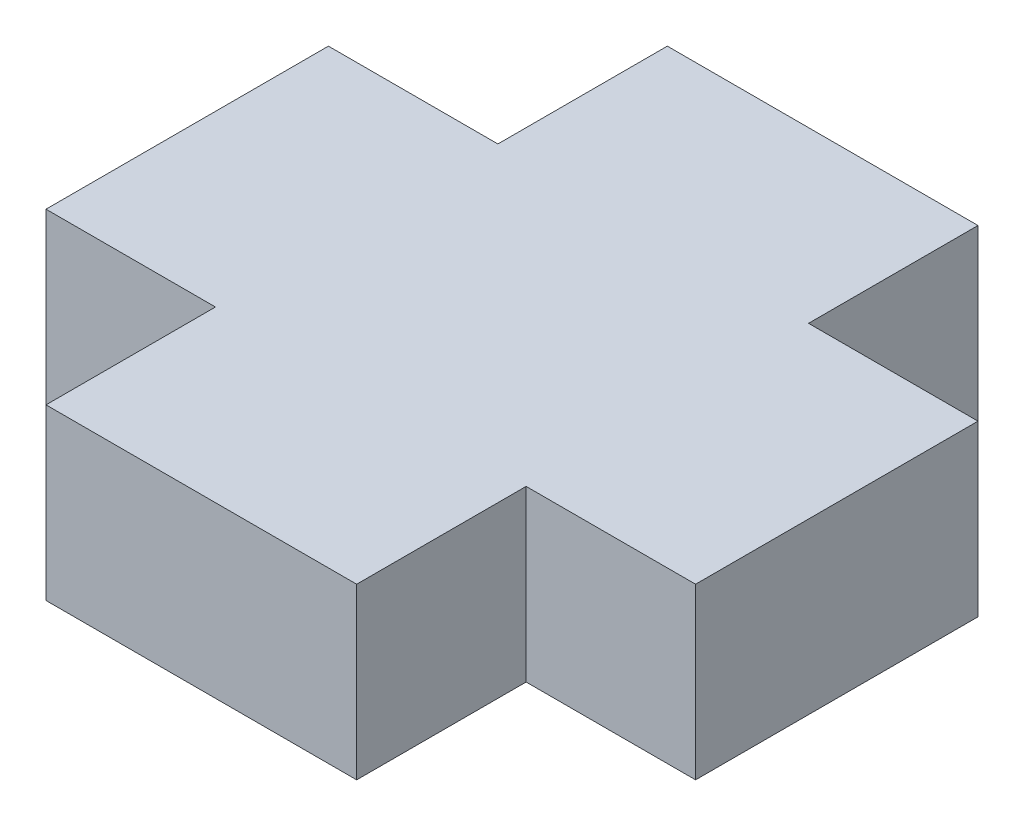
ISO-10303-21;
HEADER;
FILE_DESCRIPTION(('STEP AP214'),'2;1');
FILE_NAME('part.step','',(''),(''),'','','');
FILE_SCHEMA(('AUTOMOTIVE_DESIGN { 1 0 10303 214 1 1 1 1 }'));
ENDSEC;
DATA;
#1=APPLICATION_CONTEXT('core data for automotive mechanical design processes');
#2=APPLICATION_PROTOCOL_DEFINITION('international standard','automotive_design',2000,#1);
#3=PRODUCT_CONTEXT('',#1,'mechanical');
#4=PRODUCT('Part','Part','',(#3));
#5=PRODUCT_RELATED_PRODUCT_CATEGORY('part','',(#4));
#6=PRODUCT_DEFINITION_FORMATION('','',#4);
#7=PRODUCT_DEFINITION_CONTEXT('part definition',#1,'design');
#8=PRODUCT_DEFINITION('design','',#6,#7);
#9=PRODUCT_DEFINITION_SHAPE('','',#8);
#10=(LENGTH_UNIT() NAMED_UNIT(*) SI_UNIT(.MILLI.,.METRE.));
#11=(NAMED_UNIT(*) PLANE_ANGLE_UNIT() SI_UNIT($,.RADIAN.));
#12=(NAMED_UNIT(*) SI_UNIT($,.STERADIAN.) SOLID_ANGLE_UNIT());
#13=UNCERTAINTY_MEASURE_WITH_UNIT(LENGTH_MEASURE(1.E-05),#10,'distance_accuracy_value','');
#14=(GEOMETRIC_REPRESENTATION_CONTEXT(3) GLOBAL_UNCERTAINTY_ASSIGNED_CONTEXT((#13)) GLOBAL_UNIT_ASSIGNED_CONTEXT((#10,
#11,#12)) REPRESENTATION_CONTEXT('',''));
#15=CARTESIAN_POINT('',(0.,0.,0.));
#16=DIRECTION('',(0.,0.,1.));
#17=DIRECTION('',(1.,0.,0.));
#18=AXIS2_PLACEMENT_3D('',#15,#16,#17);
#19=CARTESIAN_POINT('',(-16.2201019104358,3.,-0.655329845418991));
#20=DIRECTION('',(0.,0.,1.));
#21=DIRECTION('',(1.,0.,0.));
#22=AXIS2_PLACEMENT_3D('',#19,#20,#21);
#23=PLANE('',#22);
#24=DIRECTION('',(-1.,0.,0.));
#25=VECTOR('',#24,1.);
#26=CARTESIAN_POINT('',(-16.2201019104358,0.,-0.655329845418991));
#27=LINE('',#26,#25);
#28=CARTESIAN_POINT('',(-13.2201019104358,0.,-0.655329845418991));
#29=VERTEX_POINT('',#28);
#30=CARTESIAN_POINT('',(-16.2201019104358,0.,-0.655329845418991));
#31=VERTEX_POINT('',#30);
#32=EDGE_CURVE('E153',#29,#31,#27,.T.);
#33=ORIENTED_EDGE('',*,*,#32,.T.);
#34=DIRECTION('',(0.,-1.,0.));
#35=VECTOR('',#34,1.);
#36=CARTESIAN_POINT('',(-16.2201019104358,3.,-0.655329845418991));
#37=LINE('',#36,#35);
#38=CARTESIAN_POINT('',(-16.2201019104358,3.,-0.655329845418991));
#39=VERTEX_POINT('',#38);
#40=EDGE_CURVE('E11',#39,#31,#37,.T.);
#41=ORIENTED_EDGE('',*,*,#40,.F.);
#42=DIRECTION('',(-1.,0.,0.));
#43=VECTOR('',#42,1.);
#44=CARTESIAN_POINT('',(-16.2201019104358,3.,-0.655329845418991));
#45=LINE('',#44,#43);
#46=CARTESIAN_POINT('',(-13.2201019104358,3.,-0.655329845418991));
#47=VERTEX_POINT('',#46);
#48=EDGE_CURVE('E175',#47,#39,#45,.T.);
#49=ORIENTED_EDGE('',*,*,#48,.F.);
#50=DIRECTION('',(0.,-1.,0.));
#51=VECTOR('',#50,1.);
#52=CARTESIAN_POINT('',(-13.2201019104358,3.,-0.655329845418991));
#53=LINE('',#52,#51);
#54=EDGE_CURVE('E149',#47,#29,#53,.T.);
#55=ORIENTED_EDGE('',*,*,#54,.T.);
#56=EDGE_LOOP('',(#33,#41,#49,#55));
#57=FACE_BOUND('',#56,.T.);
#58=ADVANCED_FACE('F33',(#57),#23,.F.);
#59=CARTESIAN_POINT('',(-16.2201019104358,3.,4.34467015458101));
#60=DIRECTION('',(1.,0.,0.));
#61=DIRECTION('',(0.,0.,-1.));
#62=AXIS2_PLACEMENT_3D('',#59,#60,#61);
#63=PLANE('',#62);
#64=DIRECTION('',(0.,0.,1.));
#65=VECTOR('',#64,1.);
#66=CARTESIAN_POINT('',(-16.2201019104358,0.,4.34467015458101));
#67=LINE('',#66,#65);
#68=CARTESIAN_POINT('',(-16.2201019104358,0.,4.34467015458101));
#69=VERTEX_POINT('',#68);
#70=EDGE_CURVE('E156',#31,#69,#67,.T.);
#71=ORIENTED_EDGE('',*,*,#70,.T.);
#72=DIRECTION('',(0.,-1.,0.));
#73=VECTOR('',#72,1.);
#74=CARTESIAN_POINT('',(-16.2201019104358,3.,4.34467015458101));
#75=LINE('',#74,#73);
#76=CARTESIAN_POINT('',(-16.2201019104358,3.,4.34467015458101));
#77=VERTEX_POINT('',#76);
#78=EDGE_CURVE('E41',#77,#69,#75,.T.);
#79=ORIENTED_EDGE('',*,*,#78,.F.);
#80=DIRECTION('',(0.,0.,1.));
#81=VECTOR('',#80,1.);
#82=CARTESIAN_POINT('',(-16.2201019104358,3.,4.34467015458101));
#83=LINE('',#82,#81);
#84=EDGE_CURVE('E104',#39,#77,#83,.T.);
#85=ORIENTED_EDGE('',*,*,#84,.F.);
#86=ORIENTED_EDGE('',*,*,#40,.T.);
#87=EDGE_LOOP('',(#71,#79,#85,#86));
#88=FACE_BOUND('',#87,.T.);
#89=ADVANCED_FACE('F253',(#88),#63,.F.);
#90=CARTESIAN_POINT('',(-13.2201019104358,3.,4.34467015458101));
#91=DIRECTION('',(0.,0.,-1.));
#92=DIRECTION('',(-1.,0.,0.));
#93=AXIS2_PLACEMENT_3D('',#90,#91,#92);
#94=PLANE('',#93);
#95=DIRECTION('',(1.,0.,0.));
#96=VECTOR('',#95,1.);
#97=CARTESIAN_POINT('',(-13.2201019104358,0.,4.34467015458101));
#98=LINE('',#97,#96);
#99=CARTESIAN_POINT('',(-13.2201019104358,0.,4.34467015458101));
#100=VERTEX_POINT('',#99);
#101=EDGE_CURVE('E158',#69,#100,#98,.T.);
#102=ORIENTED_EDGE('',*,*,#101,.T.);
#103=DIRECTION('',(0.,-1.,0.));
#104=VECTOR('',#103,1.);
#105=CARTESIAN_POINT('',(-13.2201019104358,3.,4.34467015458101));
#106=LINE('',#105,#104);
#107=CARTESIAN_POINT('',(-13.2201019104358,3.,4.34467015458101));
#108=VERTEX_POINT('',#107);
#109=EDGE_CURVE('E194',#108,#100,#106,.T.);
#110=ORIENTED_EDGE('',*,*,#109,.F.);
#111=DIRECTION('',(1.,0.,0.));
#112=VECTOR('',#111,1.);
#113=CARTESIAN_POINT('',(-13.2201019104358,3.,4.34467015458101));
#114=LINE('',#113,#112);
#115=EDGE_CURVE('E202',#77,#108,#114,.T.);
#116=ORIENTED_EDGE('',*,*,#115,.F.);
#117=ORIENTED_EDGE('',*,*,#78,.T.);
#118=EDGE_LOOP('',(#102,#110,#116,#117));
#119=FACE_BOUND('',#118,.T.);
#120=ADVANCED_FACE('F200',(#119),#94,.F.);
#121=CARTESIAN_POINT('',(-13.2201019104358,3.,7.34467015458101));
#122=DIRECTION('',(1.,0.,0.));
#123=DIRECTION('',(0.,0.,-1.));
#124=AXIS2_PLACEMENT_3D('',#121,#122,#123);
#125=PLANE('',#124);
#126=DIRECTION('',(0.,0.,1.));
#127=VECTOR('',#126,1.);
#128=CARTESIAN_POINT('',(-13.2201019104358,0.,7.34467015458101));
#129=LINE('',#128,#127);
#130=CARTESIAN_POINT('',(-13.2201019104358,0.,7.34467015458101));
#131=VERTEX_POINT('',#130);
#132=EDGE_CURVE('E160',#100,#131,#129,.T.);
#133=ORIENTED_EDGE('',*,*,#132,.T.);
#134=DIRECTION('',(0.,-1.,0.));
#135=VECTOR('',#134,1.);
#136=CARTESIAN_POINT('',(-13.2201019104358,3.,7.34467015458101));
#137=LINE('',#136,#135);
#138=CARTESIAN_POINT('',(-13.2201019104358,3.,7.34467015458101));
#139=VERTEX_POINT('',#138);
#140=EDGE_CURVE('E191',#139,#131,#137,.T.);
#141=ORIENTED_EDGE('',*,*,#140,.F.);
#142=DIRECTION('',(0.,0.,1.));
#143=VECTOR('',#142,1.);
#144=CARTESIAN_POINT('',(-13.2201019104358,3.,7.34467015458101));
#145=LINE('',#144,#143);
#146=EDGE_CURVE('E220',#108,#139,#145,.T.);
#147=ORIENTED_EDGE('',*,*,#146,.F.);
#148=ORIENTED_EDGE('',*,*,#109,.T.);
#149=EDGE_LOOP('',(#133,#141,#147,#148));
#150=FACE_BOUND('',#149,.T.);
#151=ADVANCED_FACE('F211',(#150),#125,.F.);
#152=CARTESIAN_POINT('',(-7.7201019104358,3.,7.34467015458101));
#153=DIRECTION('',(0.,0.,-1.));
#154=DIRECTION('',(-1.,0.,0.));
#155=AXIS2_PLACEMENT_3D('',#152,#153,#154);
#156=PLANE('',#155);
#157=DIRECTION('',(1.,0.,0.));
#158=VECTOR('',#157,1.);
#159=CARTESIAN_POINT('',(-7.7201019104358,0.,7.34467015458101));
#160=LINE('',#159,#158);
#161=CARTESIAN_POINT('',(-7.7201019104358,0.,7.34467015458101));
#162=VERTEX_POINT('',#161);
#163=EDGE_CURVE('E162',#131,#162,#160,.T.);
#164=ORIENTED_EDGE('',*,*,#163,.T.);
#165=DIRECTION('',(0.,-1.,0.));
#166=VECTOR('',#165,1.);
#167=CARTESIAN_POINT('',(-7.7201019104358,3.,7.34467015458101));
#168=LINE('',#167,#166);
#169=CARTESIAN_POINT('',(-7.7201019104358,3.,7.34467015458101));
#170=VERTEX_POINT('',#169);
#171=EDGE_CURVE('E188',#170,#162,#168,.T.);
#172=ORIENTED_EDGE('',*,*,#171,.F.);
#173=DIRECTION('',(1.,0.,0.));
#174=VECTOR('',#173,1.);
#175=CARTESIAN_POINT('',(-7.7201019104358,3.,7.34467015458101));
#176=LINE('',#175,#174);
#177=EDGE_CURVE('E217',#139,#170,#176,.T.);
#178=ORIENTED_EDGE('',*,*,#177,.F.);
#179=ORIENTED_EDGE('',*,*,#140,.T.);
#180=EDGE_LOOP('',(#164,#172,#178,#179));
#181=FACE_BOUND('',#180,.T.);
#182=ADVANCED_FACE('F215',(#181),#156,.F.);
#183=CARTESIAN_POINT('',(-7.7201019104358,3.,4.34467015458101));
#184=DIRECTION('',(-1.,0.,0.));
#185=DIRECTION('',(0.,0.,1.));
#186=AXIS2_PLACEMENT_3D('',#183,#184,#185);
#187=PLANE('',#186);
#188=DIRECTION('',(0.,0.,-1.));
#189=VECTOR('',#188,1.);
#190=CARTESIAN_POINT('',(-7.7201019104358,0.,4.34467015458101));
#191=LINE('',#190,#189);
#192=CARTESIAN_POINT('',(-7.7201019104358,0.,4.34467015458101));
#193=VERTEX_POINT('',#192);
#194=EDGE_CURVE('E164',#162,#193,#191,.T.);
#195=ORIENTED_EDGE('',*,*,#194,.T.);
#196=DIRECTION('',(0.,-1.,0.));
#197=VECTOR('',#196,1.);
#198=CARTESIAN_POINT('',(-7.7201019104358,3.,4.34467015458101));
#199=LINE('',#198,#197);
#200=CARTESIAN_POINT('',(-7.7201019104358,3.,4.34467015458101));
#201=VERTEX_POINT('',#200);
#202=EDGE_CURVE('E185',#201,#193,#199,.T.);
#203=ORIENTED_EDGE('',*,*,#202,.F.);
#204=DIRECTION('',(0.,0.,-1.));
#205=VECTOR('',#204,1.);
#206=CARTESIAN_POINT('',(-7.7201019104358,3.,4.34467015458101));
#207=LINE('',#206,#205);
#208=EDGE_CURVE('E219',#170,#201,#207,.T.);
#209=ORIENTED_EDGE('',*,*,#208,.F.);
#210=ORIENTED_EDGE('',*,*,#171,.T.);
#211=EDGE_LOOP('',(#195,#203,#209,#210));
#212=FACE_BOUND('',#211,.T.);
#213=ADVANCED_FACE('F266',(#212),#187,.F.);
#214=CARTESIAN_POINT('',(-4.7201019104358,3.,4.34467015458101));
#215=DIRECTION('',(0.,0.,-1.));
#216=DIRECTION('',(-1.,0.,0.));
#217=AXIS2_PLACEMENT_3D('',#214,#215,#216);
#218=PLANE('',#217);
#219=DIRECTION('',(1.,0.,0.));
#220=VECTOR('',#219,1.);
#221=CARTESIAN_POINT('',(-4.7201019104358,0.,4.34467015458101));
#222=LINE('',#221,#220);
#223=CARTESIAN_POINT('',(-4.7201019104358,0.,4.34467015458101));
#224=VERTEX_POINT('',#223);
#225=EDGE_CURVE('E166',#193,#224,#222,.T.);
#226=ORIENTED_EDGE('',*,*,#225,.T.);
#227=DIRECTION('',(0.,-1.,0.));
#228=VECTOR('',#227,1.);
#229=CARTESIAN_POINT('',(-4.7201019104358,3.,4.34467015458101));
#230=LINE('',#229,#228);
#231=CARTESIAN_POINT('',(-4.7201019104358,3.,4.34467015458101));
#232=VERTEX_POINT('',#231);
#233=EDGE_CURVE('E182',#232,#224,#230,.T.);
#234=ORIENTED_EDGE('',*,*,#233,.F.);
#235=DIRECTION('',(1.,0.,0.));
#236=VECTOR('',#235,1.);
#237=CARTESIAN_POINT('',(-4.7201019104358,3.,4.34467015458101));
#238=LINE('',#237,#236);
#239=EDGE_CURVE('E222',#201,#232,#238,.T.);
#240=ORIENTED_EDGE('',*,*,#239,.F.);
#241=ORIENTED_EDGE('',*,*,#202,.T.);
#242=EDGE_LOOP('',(#226,#234,#240,#241));
#243=FACE_BOUND('',#242,.T.);
#244=ADVANCED_FACE('F269',(#243),#218,.F.);
#245=CARTESIAN_POINT('',(-4.7201019104358,3.,-0.655329845418991));
#246=DIRECTION('',(-1.,0.,0.));
#247=DIRECTION('',(0.,0.,1.));
#248=AXIS2_PLACEMENT_3D('',#245,#246,#247);
#249=PLANE('',#248);
#250=DIRECTION('',(0.,0.,-1.));
#251=VECTOR('',#250,1.);
#252=CARTESIAN_POINT('',(-4.7201019104358,0.,-0.655329845418991));
#253=LINE('',#252,#251);
#254=CARTESIAN_POINT('',(-4.7201019104358,0.,-0.655329845418991));
#255=VERTEX_POINT('',#254);
#256=EDGE_CURVE('E168',#224,#255,#253,.T.);
#257=ORIENTED_EDGE('',*,*,#256,.T.);
#258=DIRECTION('',(0.,-1.,0.));
#259=VECTOR('',#258,1.);
#260=CARTESIAN_POINT('',(-4.7201019104358,3.,-0.655329845418991));
#261=LINE('',#260,#259);
#262=CARTESIAN_POINT('',(-4.7201019104358,3.,-0.655329845418991));
#263=VERTEX_POINT('',#262);
#264=EDGE_CURVE('E179',#263,#255,#261,.T.);
#265=ORIENTED_EDGE('',*,*,#264,.F.);
#266=DIRECTION('',(0.,0.,-1.));
#267=VECTOR('',#266,1.);
#268=CARTESIAN_POINT('',(-4.7201019104358,3.,-0.655329845418991));
#269=LINE('',#268,#267);
#270=EDGE_CURVE('E228',#232,#263,#269,.T.);
#271=ORIENTED_EDGE('',*,*,#270,.F.);
#272=ORIENTED_EDGE('',*,*,#233,.T.);
#273=EDGE_LOOP('',(#257,#265,#271,#272));
#274=FACE_BOUND('',#273,.T.);
#275=ADVANCED_FACE('F234',(#274),#249,.F.);
#276=CARTESIAN_POINT('',(-7.7201019104358,3.,-0.655329845418991));
#277=DIRECTION('',(0.,0.,1.));
#278=DIRECTION('',(1.,0.,0.));
#279=AXIS2_PLACEMENT_3D('',#276,#277,#278);
#280=PLANE('',#279);
#281=DIRECTION('',(-1.,0.,0.));
#282=VECTOR('',#281,1.);
#283=CARTESIAN_POINT('',(-7.7201019104358,0.,-0.655329845418991));
#284=LINE('',#283,#282);
#285=CARTESIAN_POINT('',(-7.7201019104358,0.,-0.655329845418991));
#286=VERTEX_POINT('',#285);
#287=EDGE_CURVE('E170',#255,#286,#284,.T.);
#288=ORIENTED_EDGE('',*,*,#287,.T.);
#289=DIRECTION('',(0.,-1.,0.));
#290=VECTOR('',#289,1.);
#291=CARTESIAN_POINT('',(-7.7201019104358,3.,-0.655329845418991));
#292=LINE('',#291,#290);
#293=CARTESIAN_POINT('',(-7.7201019104358,3.,-0.655329845418991));
#294=VERTEX_POINT('',#293);
#295=EDGE_CURVE('E144',#294,#286,#292,.T.);
#296=ORIENTED_EDGE('',*,*,#295,.F.);
#297=DIRECTION('',(-1.,0.,0.));
#298=VECTOR('',#297,1.);
#299=CARTESIAN_POINT('',(-7.7201019104358,3.,-0.655329845418991));
#300=LINE('',#299,#298);
#301=EDGE_CURVE('E135',#263,#294,#300,.T.);
#302=ORIENTED_EDGE('',*,*,#301,.F.);
#303=ORIENTED_EDGE('',*,*,#264,.T.);
#304=EDGE_LOOP('',(#288,#296,#302,#303));
#305=FACE_BOUND('',#304,.T.);
#306=ADVANCED_FACE('F238',(#305),#280,.F.);
#307=CARTESIAN_POINT('',(-7.7201019104358,3.,-3.65532984541899));
#308=DIRECTION('',(-1.,0.,0.));
#309=DIRECTION('',(0.,0.,1.));
#310=AXIS2_PLACEMENT_3D('',#307,#308,#309);
#311=PLANE('',#310);
#312=DIRECTION('',(0.,0.,-1.));
#313=VECTOR('',#312,1.);
#314=CARTESIAN_POINT('',(-7.7201019104358,0.,-3.65532984541899));
#315=LINE('',#314,#313);
#316=CARTESIAN_POINT('',(-7.7201019104358,0.,-3.65532984541899));
#317=VERTEX_POINT('',#316);
#318=EDGE_CURVE('E143',#286,#317,#315,.T.);
#319=ORIENTED_EDGE('',*,*,#318,.T.);
#320=DIRECTION('',(0.,-1.,0.));
#321=VECTOR('',#320,1.);
#322=CARTESIAN_POINT('',(-7.7201019104358,3.,-3.65532984541899));
#323=LINE('',#322,#321);
#324=CARTESIAN_POINT('',(-7.7201019104358,3.,-3.65532984541899));
#325=VERTEX_POINT('',#324);
#326=EDGE_CURVE('E140',#325,#317,#323,.T.);
#327=ORIENTED_EDGE('',*,*,#326,.F.);
#328=DIRECTION('',(0.,0.,-1.));
#329=VECTOR('',#328,1.);
#330=CARTESIAN_POINT('',(-7.7201019104358,3.,-3.65532984541899));
#331=LINE('',#330,#329);
#332=EDGE_CURVE('E129',#294,#325,#331,.T.);
#333=ORIENTED_EDGE('',*,*,#332,.F.);
#334=ORIENTED_EDGE('',*,*,#295,.T.);
#335=EDGE_LOOP('',(#319,#327,#333,#334));
#336=FACE_BOUND('',#335,.T.);
#337=ADVANCED_FACE('F141',(#336),#311,.F.);
#338=CARTESIAN_POINT('',(-13.2201019104358,3.,-3.65532984541899));
#339=DIRECTION('',(0.,0.,1.));
#340=DIRECTION('',(1.,0.,0.));
#341=AXIS2_PLACEMENT_3D('',#338,#339,#340);
#342=PLANE('',#341);
#343=DIRECTION('',(-1.,0.,0.));
#344=VECTOR('',#343,1.);
#345=CARTESIAN_POINT('',(-13.2201019104358,0.,-3.65532984541899));
#346=LINE('',#345,#344);
#347=CARTESIAN_POINT('',(-13.2201019104358,0.,-3.65532984541899));
#348=VERTEX_POINT('',#347);
#349=EDGE_CURVE('E90',#317,#348,#346,.T.);
#350=ORIENTED_EDGE('',*,*,#349,.T.);
#351=DIRECTION('',(0.,-1.,0.));
#352=VECTOR('',#351,1.);
#353=CARTESIAN_POINT('',(-13.2201019104358,3.,-3.65532984541899));
#354=LINE('',#353,#352);
#355=CARTESIAN_POINT('',(-13.2201019104358,3.,-3.65532984541899));
#356=VERTEX_POINT('',#355);
#357=EDGE_CURVE('E145',#356,#348,#354,.T.);
#358=ORIENTED_EDGE('',*,*,#357,.F.);
#359=DIRECTION('',(-1.,0.,0.));
#360=VECTOR('',#359,1.);
#361=CARTESIAN_POINT('',(-13.2201019104358,3.,-3.65532984541899));
#362=LINE('',#361,#360);
#363=EDGE_CURVE('E133',#325,#356,#362,.T.);
#364=ORIENTED_EDGE('',*,*,#363,.F.);
#365=ORIENTED_EDGE('',*,*,#326,.T.);
#366=EDGE_LOOP('',(#350,#358,#364,#365));
#367=FACE_BOUND('',#366,.T.);
#368=ADVANCED_FACE('F147',(#367),#342,.F.);
#369=CARTESIAN_POINT('',(-13.2201019104358,3.,-0.655329845418991));
#370=DIRECTION('',(1.,0.,0.));
#371=DIRECTION('',(0.,0.,-1.));
#372=AXIS2_PLACEMENT_3D('',#369,#370,#371);
#373=PLANE('',#372);
#374=DIRECTION('',(0.,0.,1.));
#375=VECTOR('',#374,1.);
#376=CARTESIAN_POINT('',(-13.2201019104358,0.,-0.655329845418991));
#377=LINE('',#376,#375);
#378=EDGE_CURVE('E96',#348,#29,#377,.T.);
#379=ORIENTED_EDGE('',*,*,#378,.T.);
#380=ORIENTED_EDGE('',*,*,#54,.F.);
#381=DIRECTION('',(0.,0.,1.));
#382=VECTOR('',#381,1.);
#383=CARTESIAN_POINT('',(-13.2201019104358,3.,-0.655329845418991));
#384=LINE('',#383,#382);
#385=EDGE_CURVE('E49',#356,#47,#384,.T.);
#386=ORIENTED_EDGE('',*,*,#385,.F.);
#387=ORIENTED_EDGE('',*,*,#357,.T.);
#388=EDGE_LOOP('',(#379,#380,#386,#387));
#389=FACE_BOUND('',#388,.T.);
#390=ADVANCED_FACE('F242',(#389),#373,.F.);
#391=CARTESIAN_POINT('',(0.,3.,0.));
#392=DIRECTION('',(0.,1.,0.));
#393=DIRECTION('',(0.,0.,1.));
#394=AXIS2_PLACEMENT_3D('',#391,#392,#393);
#395=PLANE('',#394);
#396=ORIENTED_EDGE('',*,*,#48,.T.);
#397=ORIENTED_EDGE('',*,*,#84,.T.);
#398=ORIENTED_EDGE('',*,*,#115,.T.);
#399=ORIENTED_EDGE('',*,*,#146,.T.);
#400=ORIENTED_EDGE('',*,*,#177,.T.);
#401=ORIENTED_EDGE('',*,*,#208,.T.);
#402=ORIENTED_EDGE('',*,*,#239,.T.);
#403=ORIENTED_EDGE('',*,*,#270,.T.);
#404=ORIENTED_EDGE('',*,*,#301,.T.);
#405=ORIENTED_EDGE('',*,*,#332,.T.);
#406=ORIENTED_EDGE('',*,*,#363,.T.);
#407=ORIENTED_EDGE('',*,*,#385,.T.);
#408=EDGE_LOOP('',(#396,#397,#398,#399,#400,#401,#402,#403,#404,#405,#406,#407));
#409=FACE_BOUND('',#408,.T.);
#410=ADVANCED_FACE('F131',(#409),#395,.T.);
#411=CARTESIAN_POINT('',(0.,0.,0.));
#412=DIRECTION('',(0.,1.,0.));
#413=DIRECTION('',(0.,0.,1.));
#414=AXIS2_PLACEMENT_3D('',#411,#412,#413);
#415=PLANE('',#414);
#416=ORIENTED_EDGE('',*,*,#32,.F.);
#417=ORIENTED_EDGE('',*,*,#378,.F.);
#418=ORIENTED_EDGE('',*,*,#349,.F.);
#419=ORIENTED_EDGE('',*,*,#318,.F.);
#420=ORIENTED_EDGE('',*,*,#287,.F.);
#421=ORIENTED_EDGE('',*,*,#256,.F.);
#422=ORIENTED_EDGE('',*,*,#225,.F.);
#423=ORIENTED_EDGE('',*,*,#194,.F.);
#424=ORIENTED_EDGE('',*,*,#163,.F.);
#425=ORIENTED_EDGE('',*,*,#132,.F.);
#426=ORIENTED_EDGE('',*,*,#101,.F.);
#427=ORIENTED_EDGE('',*,*,#70,.F.);
#428=EDGE_LOOP('',(#416,#417,#418,#419,#420,#421,#422,#423,#424,#425,#426,#427));
#429=FACE_BOUND('',#428,.T.);
#430=ADVANCED_FACE('F206',(#429),#415,.F.);
#431=CLOSED_SHELL('',(#58,#89,#120,#151,#182,#213,#244,#275,#306,#337,#368,#390,#410,#430));
#432=MANIFOLD_SOLID_BREP('B2',#431);
#433=ADVANCED_BREP_SHAPE_REPRESENTATION('',(#18,#432),#14);
#434=SHAPE_DEFINITION_REPRESENTATION(#9,#433);
ENDSEC;
END-ISO-10303-21;
